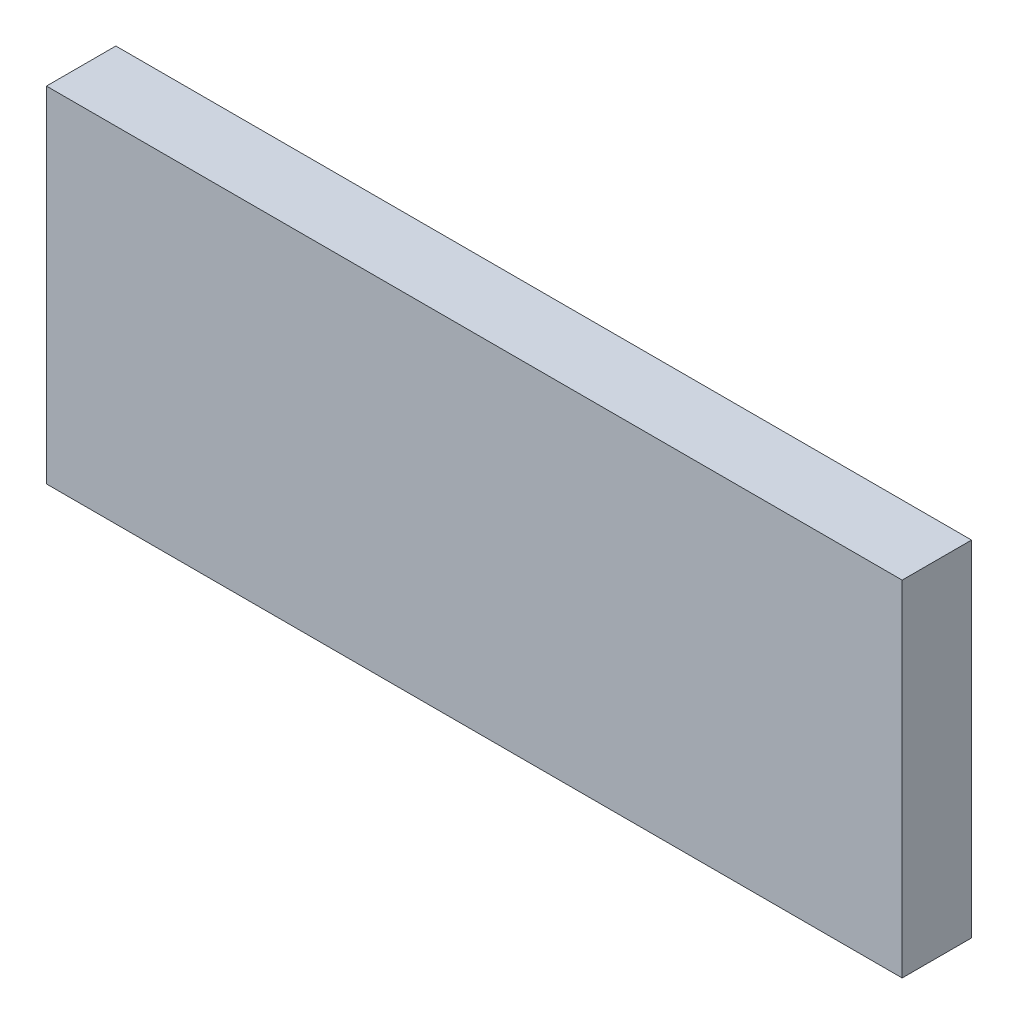
ISO-10303-21;
HEADER;
FILE_DESCRIPTION(('STEP AP214'),'2;1');
FILE_NAME('part.step','',(''),(''),'','','');
FILE_SCHEMA(('AUTOMOTIVE_DESIGN { 1 0 10303 214 1 1 1 1 }'));
ENDSEC;
DATA;
#1=APPLICATION_CONTEXT('core data for automotive mechanical design processes');
#2=APPLICATION_PROTOCOL_DEFINITION('international standard','automotive_design',2000,#1);
#3=PRODUCT_CONTEXT('',#1,'mechanical');
#4=PRODUCT('Part','Part','',(#3));
#5=PRODUCT_RELATED_PRODUCT_CATEGORY('part','',(#4));
#6=PRODUCT_DEFINITION_FORMATION('','',#4);
#7=PRODUCT_DEFINITION_CONTEXT('part definition',#1,'design');
#8=PRODUCT_DEFINITION('design','',#6,#7);
#9=PRODUCT_DEFINITION_SHAPE('','',#8);
#10=(LENGTH_UNIT() NAMED_UNIT(*) SI_UNIT(.MILLI.,.METRE.));
#11=(NAMED_UNIT(*) PLANE_ANGLE_UNIT() SI_UNIT($,.RADIAN.));
#12=(NAMED_UNIT(*) SI_UNIT($,.STERADIAN.) SOLID_ANGLE_UNIT());
#13=UNCERTAINTY_MEASURE_WITH_UNIT(LENGTH_MEASURE(1.E-05),#10,'distance_accuracy_value','');
#14=(GEOMETRIC_REPRESENTATION_CONTEXT(3) GLOBAL_UNCERTAINTY_ASSIGNED_CONTEXT((#13)) GLOBAL_UNIT_ASSIGNED_CONTEXT((#10,
#11,#12)) REPRESENTATION_CONTEXT('',''));
#15=CARTESIAN_POINT('',(0.,0.,0.));
#16=DIRECTION('',(0.,0.,1.));
#17=DIRECTION('',(1.,0.,0.));
#18=AXIS2_PLACEMENT_3D('',#15,#16,#17);
#19=CARTESIAN_POINT('',(12.5,6.,3.));
#20=DIRECTION('',(-1.,0.,0.));
#21=DIRECTION('',(0.,-1.,0.));
#22=AXIS2_PLACEMENT_3D('',#19,#20,#21);
#23=PLANE('',#22);
#24=DIRECTION('',(0.,1.,0.));
#25=VECTOR('',#24,1.);
#26=CARTESIAN_POINT('',(12.5,6.,0.));
#27=LINE('',#26,#25);
#28=CARTESIAN_POINT('',(12.5,-8.9,0.));
#29=VERTEX_POINT('',#28);
#30=CARTESIAN_POINT('',(12.5,6.,0.));
#31=VERTEX_POINT('',#30);
#32=EDGE_CURVE('E96',#29,#31,#27,.T.);
#33=ORIENTED_EDGE('',*,*,#32,.T.);
#34=DIRECTION('',(0.,0.,-1.));
#35=VECTOR('',#34,1.);
#36=CARTESIAN_POINT('',(12.5,6.,3.));
#37=LINE('',#36,#35);
#38=CARTESIAN_POINT('',(12.5,6.,3.));
#39=VERTEX_POINT('',#38);
#40=EDGE_CURVE('E11',#39,#31,#37,.T.);
#41=ORIENTED_EDGE('',*,*,#40,.F.);
#42=DIRECTION('',(0.,1.,0.));
#43=VECTOR('',#42,1.);
#44=CARTESIAN_POINT('',(12.5,6.,3.));
#45=LINE('',#44,#43);
#46=CARTESIAN_POINT('',(12.5,-8.9,3.));
#47=VERTEX_POINT('',#46);
#48=EDGE_CURVE('E84',#47,#39,#45,.T.);
#49=ORIENTED_EDGE('',*,*,#48,.F.);
#50=DIRECTION('',(0.,0.,-1.));
#51=VECTOR('',#50,1.);
#52=CARTESIAN_POINT('',(12.5,-8.9,3.));
#53=LINE('',#52,#51);
#54=EDGE_CURVE('E92',#47,#29,#53,.T.);
#55=ORIENTED_EDGE('',*,*,#54,.T.);
#56=EDGE_LOOP('',(#33,#41,#49,#55));
#57=FACE_BOUND('',#56,.T.);
#58=ADVANCED_FACE('F33',(#57),#23,.F.);
#59=CARTESIAN_POINT('',(-24.5,6.,3.));
#60=DIRECTION('',(0.,-1.,0.));
#61=DIRECTION('',(0.,0.,-1.));
#62=AXIS2_PLACEMENT_3D('',#59,#60,#61);
#63=PLANE('',#62);
#64=DIRECTION('',(-1.,0.,0.));
#65=VECTOR('',#64,1.);
#66=CARTESIAN_POINT('',(-24.5,6.,0.));
#67=LINE('',#66,#65);
#68=CARTESIAN_POINT('',(-24.5,6.,0.));
#69=VERTEX_POINT('',#68);
#70=EDGE_CURVE('E88',#31,#69,#67,.T.);
#71=ORIENTED_EDGE('',*,*,#70,.T.);
#72=DIRECTION('',(0.,0.,-1.));
#73=VECTOR('',#72,1.);
#74=CARTESIAN_POINT('',(-24.5,6.,3.));
#75=LINE('',#74,#73);
#76=CARTESIAN_POINT('',(-24.5,6.,3.));
#77=VERTEX_POINT('',#76);
#78=EDGE_CURVE('E41',#77,#69,#75,.T.);
#79=ORIENTED_EDGE('',*,*,#78,.F.);
#80=DIRECTION('',(-1.,0.,0.));
#81=VECTOR('',#80,1.);
#82=CARTESIAN_POINT('',(-24.5,6.,3.));
#83=LINE('',#82,#81);
#84=EDGE_CURVE('E79',#39,#77,#83,.T.);
#85=ORIENTED_EDGE('',*,*,#84,.F.);
#86=ORIENTED_EDGE('',*,*,#40,.T.);
#87=EDGE_LOOP('',(#71,#79,#85,#86));
#88=FACE_BOUND('',#87,.T.);
#89=ADVANCED_FACE('F87',(#88),#63,.F.);
#90=CARTESIAN_POINT('',(-24.5,6.,3.));
#91=DIRECTION('',(1.,0.,0.));
#92=DIRECTION('',(0.,1.,0.));
#93=AXIS2_PLACEMENT_3D('',#90,#91,#92);
#94=PLANE('',#93);
#95=DIRECTION('',(0.,-1.,0.));
#96=VECTOR('',#95,1.);
#97=CARTESIAN_POINT('',(-24.5,6.,0.));
#98=LINE('',#97,#96);
#99=CARTESIAN_POINT('',(-24.5,-8.9,0.));
#100=VERTEX_POINT('',#99);
#101=EDGE_CURVE('E66',#69,#100,#98,.T.);
#102=ORIENTED_EDGE('',*,*,#101,.T.);
#103=DIRECTION('',(0.,0.,-1.));
#104=VECTOR('',#103,1.);
#105=CARTESIAN_POINT('',(-24.5,-8.9,3.));
#106=LINE('',#105,#104);
#107=CARTESIAN_POINT('',(-24.5,-8.9,3.));
#108=VERTEX_POINT('',#107);
#109=EDGE_CURVE('E89',#108,#100,#106,.T.);
#110=ORIENTED_EDGE('',*,*,#109,.F.);
#111=DIRECTION('',(0.,-1.,0.));
#112=VECTOR('',#111,1.);
#113=CARTESIAN_POINT('',(-24.5,6.,3.));
#114=LINE('',#113,#112);
#115=EDGE_CURVE('E82',#77,#108,#114,.T.);
#116=ORIENTED_EDGE('',*,*,#115,.F.);
#117=ORIENTED_EDGE('',*,*,#78,.T.);
#118=EDGE_LOOP('',(#102,#110,#116,#117));
#119=FACE_BOUND('',#118,.T.);
#120=ADVANCED_FACE('F90',(#119),#94,.F.);
#121=CARTESIAN_POINT('',(-24.5,-8.9,3.));
#122=DIRECTION('',(0.,1.,0.));
#123=DIRECTION('',(0.,0.,1.));
#124=AXIS2_PLACEMENT_3D('',#121,#122,#123);
#125=PLANE('',#124);
#126=DIRECTION('',(1.,0.,0.));
#127=VECTOR('',#126,1.);
#128=CARTESIAN_POINT('',(-24.5,-8.9,0.));
#129=LINE('',#128,#127);
#130=EDGE_CURVE('E72',#100,#29,#129,.T.);
#131=ORIENTED_EDGE('',*,*,#130,.T.);
#132=ORIENTED_EDGE('',*,*,#54,.F.);
#133=DIRECTION('',(1.,0.,0.));
#134=VECTOR('',#133,1.);
#135=CARTESIAN_POINT('',(-24.5,-8.9,3.));
#136=LINE('',#135,#134);
#137=EDGE_CURVE('E49',#108,#47,#136,.T.);
#138=ORIENTED_EDGE('',*,*,#137,.F.);
#139=ORIENTED_EDGE('',*,*,#109,.T.);
#140=EDGE_LOOP('',(#131,#132,#138,#139));
#141=FACE_BOUND('',#140,.T.);
#142=ADVANCED_FACE('F103',(#141),#125,.F.);
#143=CARTESIAN_POINT('',(0.,0.,3.));
#144=DIRECTION('',(0.,0.,1.));
#145=DIRECTION('',(1.,0.,0.));
#146=AXIS2_PLACEMENT_3D('',#143,#144,#145);
#147=PLANE('',#146);
#148=ORIENTED_EDGE('',*,*,#48,.T.);
#149=ORIENTED_EDGE('',*,*,#84,.T.);
#150=ORIENTED_EDGE('',*,*,#115,.T.);
#151=ORIENTED_EDGE('',*,*,#137,.T.);
#152=EDGE_LOOP('',(#148,#149,#150,#151));
#153=FACE_BOUND('',#152,.T.);
#154=ADVANCED_FACE('F80',(#153),#147,.T.);
#155=CARTESIAN_POINT('',(0.,0.,0.));
#156=DIRECTION('',(0.,0.,1.));
#157=DIRECTION('',(1.,0.,0.));
#158=AXIS2_PLACEMENT_3D('',#155,#156,#157);
#159=PLANE('',#158);
#160=ORIENTED_EDGE('',*,*,#32,.F.);
#161=ORIENTED_EDGE('',*,*,#130,.F.);
#162=ORIENTED_EDGE('',*,*,#101,.F.);
#163=ORIENTED_EDGE('',*,*,#70,.F.);
#164=EDGE_LOOP('',(#160,#161,#162,#163));
#165=FACE_BOUND('',#164,.T.);
#166=ADVANCED_FACE('F106',(#165),#159,.F.);
#167=CLOSED_SHELL('',(#58,#89,#120,#142,#154,#166));
#168=MANIFOLD_SOLID_BREP('B2',#167);
#169=ADVANCED_BREP_SHAPE_REPRESENTATION('',(#18,#168),#14);
#170=SHAPE_DEFINITION_REPRESENTATION(#9,#169);
ENDSEC;
END-ISO-10303-21;
